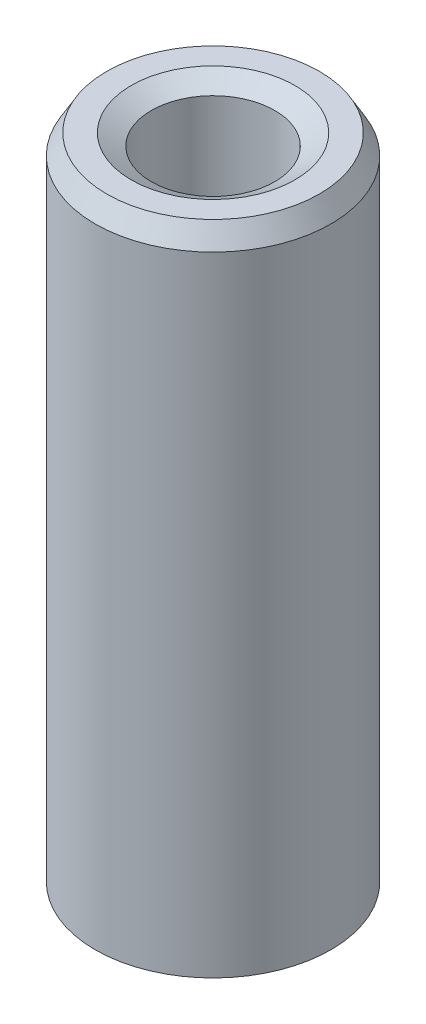
ISO-10303-21;
HEADER;
FILE_DESCRIPTION(('STEP AP214'),'2;1');
FILE_NAME('part.step','',(''),(''),'','','');
FILE_SCHEMA(('AUTOMOTIVE_DESIGN { 1 0 10303 214 1 1 1 1 }'));
ENDSEC;
DATA;
#1=APPLICATION_CONTEXT('core data for automotive mechanical design processes');
#2=APPLICATION_PROTOCOL_DEFINITION('international standard','automotive_design',2000,#1);
#3=PRODUCT_CONTEXT('',#1,'mechanical');
#4=PRODUCT('Part','Part','',(#3));
#5=PRODUCT_RELATED_PRODUCT_CATEGORY('part','',(#4));
#6=PRODUCT_DEFINITION_FORMATION('','',#4);
#7=PRODUCT_DEFINITION_CONTEXT('part definition',#1,'design');
#8=PRODUCT_DEFINITION('design','',#6,#7);
#9=PRODUCT_DEFINITION_SHAPE('','',#8);
#10=(LENGTH_UNIT() NAMED_UNIT(*) SI_UNIT(.MILLI.,.METRE.));
#11=(NAMED_UNIT(*) PLANE_ANGLE_UNIT() SI_UNIT($,.RADIAN.));
#12=(NAMED_UNIT(*) SI_UNIT($,.STERADIAN.) SOLID_ANGLE_UNIT());
#13=UNCERTAINTY_MEASURE_WITH_UNIT(LENGTH_MEASURE(1.E-05),#10,'distance_accuracy_value','');
#14=(GEOMETRIC_REPRESENTATION_CONTEXT(3) GLOBAL_UNCERTAINTY_ASSIGNED_CONTEXT((#13)) GLOBAL_UNIT_ASSIGNED_CONTEXT((#10,
#11,#12)) REPRESENTATION_CONTEXT('',''));
#15=CARTESIAN_POINT('',(0.,0.,0.));
#16=DIRECTION('',(0.,0.,1.));
#17=DIRECTION('',(1.,0.,0.));
#18=AXIS2_PLACEMENT_3D('',#15,#16,#17);
#19=CARTESIAN_POINT('',(0.,84.0063016727272,0.));
#20=DIRECTION('',(0.,-1.,0.));
#21=DIRECTION('',(0.,0.,-1.));
#22=AXIS2_PLACEMENT_3D('',#19,#20,#21);
#23=CYLINDRICAL_SURFACE('',#22,15.);
#24=CARTESIAN_POINT('',(0.,1.4764004565903,0.));
#25=DIRECTION('',(0.,1.,0.));
#26=DIRECTION('',(0.,0.,1.));
#27=AXIS2_PLACEMENT_3D('',#24,#25,#26);
#28=CIRCLE('',#27,15.);
#29=CARTESIAN_POINT('',(0.,1.4764004565903,15.));
#30=VERTEX_POINT('',#29);
#31=EDGE_CURVE('E10',#30,#30,#28,.T.);
#32=ORIENTED_EDGE('',*,*,#31,.T.);
#33=EDGE_LOOP('',(#32));
#34=FACE_BOUND('',#33,.T.);
#35=CARTESIAN_POINT('',(0.,81.4491010695949,0.));
#36=DIRECTION('',(0.,1.,0.));
#37=DIRECTION('',(0.,0.,1.));
#38=AXIS2_PLACEMENT_3D('',#35,#36,#37);
#39=CIRCLE('',#38,15.);
#40=CARTESIAN_POINT('',(0.,81.4491010695949,15.));
#41=VERTEX_POINT('',#40);
#42=EDGE_CURVE('E50',#41,#41,#39,.F.);
#43=ORIENTED_EDGE('',*,*,#42,.T.);
#44=EDGE_LOOP('',(#43));
#45=FACE_BOUND('',#44,.T.);
#46=ADVANCED_FACE('F39',(#34,#45),#23,.T.);
#47=CARTESIAN_POINT('',(0.,84.0063016727272,0.));
#48=DIRECTION('',(0.,1.,0.));
#49=DIRECTION('',(0.,0.,1.));
#50=AXIS2_PLACEMENT_3D('',#47,#48,#49);
#51=PLANE('',#50);
#52=CARTESIAN_POINT('',(0.,84.0063016727272,0.));
#53=DIRECTION('',(0.,1.,0.));
#54=DIRECTION('',(0.,0.,1.));
#55=AXIS2_PLACEMENT_3D('',#52,#53,#54);
#56=CIRCLE('',#55,10.4116400235314);
#57=CARTESIAN_POINT('',(0.,84.0063016727272,10.4116400235314));
#58=VERTEX_POINT('',#57);
#59=EDGE_CURVE('E58',#58,#58,#56,.F.);
#60=ORIENTED_EDGE('',*,*,#59,.T.);
#61=EDGE_LOOP('',(#60));
#62=FACE_BOUND('',#61,.T.);
#63=CARTESIAN_POINT('',(0.,84.0063016727272,0.));
#64=DIRECTION('',(0.,1.,0.));
#65=DIRECTION('',(0.,0.,1.));
#66=AXIS2_PLACEMENT_3D('',#63,#64,#65);
#67=CIRCLE('',#66,13.5235995434097);
#68=CARTESIAN_POINT('',(0.,84.0063016727272,13.5235995434097));
#69=VERTEX_POINT('',#68);
#70=EDGE_CURVE('E61',#69,#69,#67,.T.);
#71=ORIENTED_EDGE('',*,*,#70,.T.);
#72=EDGE_LOOP('',(#71));
#73=FACE_BOUND('',#72,.T.);
#74=ADVANCED_FACE('F88',(#62,#73),#51,.T.);
#75=CARTESIAN_POINT('',(0.,0.,0.));
#76=DIRECTION('',(0.,1.,0.));
#77=DIRECTION('',(0.,0.,1.));
#78=AXIS2_PLACEMENT_3D('',#75,#76,#77);
#79=PLANE('',#78);
#80=CARTESIAN_POINT('',(0.,0.,0.));
#81=DIRECTION('',(0.,1.,0.));
#82=DIRECTION('',(0.,0.,1.));
#83=AXIS2_PLACEMENT_3D('',#80,#81,#82);
#84=CIRCLE('',#83,9.33083987698939);
#85=CARTESIAN_POINT('',(0.,0.,9.33083987698939));
#86=VERTEX_POINT('',#85);
#87=EDGE_CURVE('E51',#86,#86,#84,.T.);
#88=ORIENTED_EDGE('',*,*,#87,.T.);
#89=EDGE_LOOP('',(#88));
#90=FACE_BOUND('',#89,.T.);
#91=CARTESIAN_POINT('',(0.,0.,0.));
#92=DIRECTION('',(0.,1.,0.));
#93=DIRECTION('',(0.,0.,1.));
#94=AXIS2_PLACEMENT_3D('',#91,#92,#93);
#95=CIRCLE('',#94,12.4427993968677);
#96=CARTESIAN_POINT('',(0.,0.,12.4427993968677));
#97=VERTEX_POINT('',#96);
#98=EDGE_CURVE('E54',#97,#97,#95,.F.);
#99=ORIENTED_EDGE('',*,*,#98,.T.);
#100=EDGE_LOOP('',(#99));
#101=FACE_BOUND('',#100,.T.);
#102=ADVANCED_FACE('F83',(#90,#101),#79,.F.);
#103=CARTESIAN_POINT('',(0.,84.0063016727272,0.));
#104=DIRECTION('',(0.,-1.,0.));
#105=DIRECTION('',(0.,0.,-1.));
#106=AXIS2_PLACEMENT_3D('',#103,#104,#105);
#107=CYLINDRICAL_SURFACE('',#106,7.85443942039906);
#108=CARTESIAN_POINT('',(0.,82.5299012161369,0.));
#109=DIRECTION('',(0.,1.,0.));
#110=DIRECTION('',(0.,0.,1.));
#111=AXIS2_PLACEMENT_3D('',#108,#109,#110);
#112=CIRCLE('',#111,7.85443942039906);
#113=CARTESIAN_POINT('',(0.,82.5299012161369,7.85443942039905));
#114=VERTEX_POINT('',#113);
#115=EDGE_CURVE('E67',#114,#114,#112,.T.);
#116=ORIENTED_EDGE('',*,*,#115,.T.);
#117=EDGE_LOOP('',(#116));
#118=FACE_BOUND('',#117,.T.);
#119=CARTESIAN_POINT('',(0.,2.55720060313236,0.));
#120=DIRECTION('',(0.,1.,0.));
#121=DIRECTION('',(0.,0.,1.));
#122=AXIS2_PLACEMENT_3D('',#119,#120,#121);
#123=CIRCLE('',#122,7.85443942039906);
#124=CARTESIAN_POINT('',(0.,2.55720060313236,7.85443942039906));
#125=VERTEX_POINT('',#124);
#126=EDGE_CURVE('E69',#125,#125,#123,.F.);
#127=ORIENTED_EDGE('',*,*,#126,.T.);
#128=EDGE_LOOP('',(#127));
#129=FACE_BOUND('',#128,.T.);
#130=ADVANCED_FACE('F71',(#118,#129),#107,.F.);
#131=CARTESIAN_POINT('',(0.,82.5299012161369,0.));
#132=DIRECTION('',(0.,1.,0.));
#133=DIRECTION('',(0.,0.,1.));
#134=AXIS2_PLACEMENT_3D('',#131,#132,#133);
#135=CONICAL_SURFACE('',#134,7.85443942039906,1.0471975511966);
#136=CARTESIAN_POINT('',(0.,84.0063016727272,10.4116400235314));
#137=CARTESIAN_POINT('',(0.,83.9909225013044,10.3850025172488));
#138=CARTESIAN_POINT('',(0.,83.9755433298816,10.3583650109661));
#139=CARTESIAN_POINT('',(0.,83.944784987036,10.3050899984009));
#140=CARTESIAN_POINT('',(0.,83.9294058156132,10.2784524921183));
#141=CARTESIAN_POINT('',(0.,83.8986474727675,10.225177479553));
#142=CARTESIAN_POINT('',(0.,83.8832683013447,10.1985399732704));
#143=CARTESIAN_POINT('',(0.,83.8525099584991,10.1452649607051));
#144=CARTESIAN_POINT('',(0.,83.8371307870762,10.1186274544225));
#145=CARTESIAN_POINT('',(0.,83.8063724442306,10.0653524418572));
#146=CARTESIAN_POINT('',(0.,83.7909932728078,10.0387149355746));
#147=CARTESIAN_POINT('',(0.,83.7602349299622,9.98543992300934));
#148=CARTESIAN_POINT('',(0.,83.7448557585393,9.95880241672671));
#149=CARTESIAN_POINT('',(0.,83.7140974156937,9.90552740416146));
#150=CARTESIAN_POINT('',(0.,83.6987182442709,9.87888989787883));
#151=CARTESIAN_POINT('',(0.,83.6679599014253,9.82561488531357));
#152=CARTESIAN_POINT('',(0.,83.6525807300025,9.79897737903094));
#153=CARTESIAN_POINT('',(0.,83.6218223871568,9.74570236646569));
#154=CARTESIAN_POINT('',(0.,83.606443215734,9.71906486018306));
#155=CARTESIAN_POINT('',(0.,83.5756848728884,9.6657898476178));
#156=CARTESIAN_POINT('',(0.,83.5603057014656,9.63915234133517));
#157=CARTESIAN_POINT('',(0.,83.5295473586199,9.58587732876991));
#158=CARTESIAN_POINT('',(0.,83.5141681871971,9.55923982248728));
#159=CARTESIAN_POINT('',(0.,83.4834098443515,9.50596480992203));
#160=CARTESIAN_POINT('',(0.,83.4680306729287,9.4793273036394));
#161=CARTESIAN_POINT('',(0.,83.437272330083,9.42605229107414));
#162=CARTESIAN_POINT('',(0.,83.4218931586602,9.39941478479151));
#163=CARTESIAN_POINT('',(0.,83.3911348158146,9.34613977222626));
#164=CARTESIAN_POINT('',(0.,83.3757556443918,9.31950226594362));
#165=CARTESIAN_POINT('',(0.,83.3449973015461,9.26622725337837));
#166=CARTESIAN_POINT('',(0.,83.3296181301233,9.23958974709574));
#167=CARTESIAN_POINT('',(0.,83.2988597872777,9.18631473453048));
#168=CARTESIAN_POINT('',(0.,83.2834806158549,9.15967722824785));
#169=CARTESIAN_POINT('',(0.,83.2527222730092,9.1064022156826));
#170=CARTESIAN_POINT('',(0.,83.2373431015864,9.07976470939997));
#171=CARTESIAN_POINT('',(0.,83.2065847587408,9.02648969683471));
#172=CARTESIAN_POINT('',(0.,83.191205587318,8.99985219055208));
#173=CARTESIAN_POINT('',(0.,83.1604472444723,8.94657717798682));
#174=CARTESIAN_POINT('',(0.,83.1450680730495,8.9199396717042));
#175=CARTESIAN_POINT('',(0.,83.1143097302039,8.86666465913894));
#176=CARTESIAN_POINT('',(0.,83.0989305587811,8.84002715285631));
#177=CARTESIAN_POINT('',(0.,83.0681722159354,8.78675214029105));
#178=CARTESIAN_POINT('',(0.,83.0527930445126,8.76011463400842));
#179=CARTESIAN_POINT('',(0.,83.022034701667,8.70683962144317));
#180=CARTESIAN_POINT('',(0.,83.0066555302442,8.68020211516054));
#181=CARTESIAN_POINT('',(0.,82.9758971873986,8.62692710259528));
#182=CARTESIAN_POINT('',(0.,82.9605180159758,8.60028959631265));
#183=CARTESIAN_POINT('',(0.,82.9297596731301,8.54701458374739));
#184=CARTESIAN_POINT('',(0.,82.9143805017073,8.52037707746477));
#185=CARTESIAN_POINT('',(0.,82.8836221588617,8.46710206489951));
#186=CARTESIAN_POINT('',(0.,82.8682429874388,8.44046455861688));
#187=CARTESIAN_POINT('',(0.,82.8374846445932,8.38718954605162));
#188=CARTESIAN_POINT('',(0.,82.8221054731704,8.36055203976899));
#189=CARTESIAN_POINT('',(0.,82.7913471303248,8.30727702720374));
#190=CARTESIAN_POINT('',(0.,82.7759679589019,8.28063952092111));
#191=CARTESIAN_POINT('',(0.,82.7452096160563,8.22736450835585));
#192=CARTESIAN_POINT('',(0.,82.7298304446335,8.20072700207322));
#193=CARTESIAN_POINT('',(0.,82.6990721017879,8.14745198950797));
#194=CARTESIAN_POINT('',(0.,82.6836929303651,8.12081448322533));
#195=CARTESIAN_POINT('',(0.,82.6529345875194,8.06753947066008));
#196=CARTESIAN_POINT('',(0.,82.6375554160966,8.04090196437745));
#197=CARTESIAN_POINT('',(0.,82.606797073251,7.98762695181219));
#198=CARTESIAN_POINT('',(0.,82.5914179018282,7.96098944552956));
#199=CARTESIAN_POINT('',(0.,82.5606595589825,7.90771443296431));
#200=CARTESIAN_POINT('',(0.,82.5452803875597,7.88107692668168));
#201=CARTESIAN_POINT('',(0.,82.5299012161369,7.85443942039905));
#202=B_SPLINE_CURVE_WITH_KNOTS('',3,(#136,#137,#138,#139,#140,#141,#142,#143,#144,#145,#146,
#147,#148,#149,#150,#151,#152,#153,#154,#155,#156,#157,#158,#159,#160,#161,#162,#163,#164,#165,
#166,#167,#168,#169,#170,#171,#172,#173,#174,#175,#176,#177,#178,#179,#180,#181,#182,#183,#184,
#185,#186,#187,#188,#189,#190,#191,#192,#193,#194,#195,#196,#197,#198,#199,#200,#201),
.UNSPECIFIED.,.F.,.F.,(4,2,2,2,2,2,2,2,2,2,2,2,2,2,2,2,2,2,2,2,2,2,2,2,2,2,2,2,2,2,2,2,4),(0.,
0.0922750285368967,0.184550057073793,0.27682508561069,0.369100114147587,0.461375142684483,
0.55365017122138,0.645925199758277,0.738200228295172,0.830475256832069,0.922750285368965,
1.01502531390585,1.10730034244275,1.19957537097965,1.29185039951655,1.38412542805344,
1.47640045659034,1.56867548512723,1.66095051366413,1.75322554220103,1.84550057073792,
1.93777559927482,2.03005062781171,2.12232565634861,2.2146006848855,2.3068757134224,
2.3991507419593,2.49142577049619,2.58370079903309,2.67597582756999,2.76825085610688,
2.86052588464378,2.95280091318067),.UNSPECIFIED.);
#203=EDGE_CURVE('BSEAM77',#58,#114,#202,.T.);
#204=ORIENTED_EDGE('',*,*,#59,.F.);
#205=ORIENTED_EDGE('',*,*,#115,.F.);
#206=ORIENTED_EDGE('',*,*,#203,.T.);
#207=ORIENTED_EDGE('',*,*,#203,.F.);
#208=EDGE_LOOP('',(#204,#206,#205,#207));
#209=FACE_BOUND('',#208,.T.);
#210=ADVANCED_FACE('F77',(#209),#135,.F.);
#211=CARTESIAN_POINT('',(0.,0.,0.));
#212=DIRECTION('',(0.,-1.,0.));
#213=DIRECTION('',(0.,0.,-1.));
#214=AXIS2_PLACEMENT_3D('',#211,#212,#213);
#215=CONICAL_SURFACE('',#214,9.33083987698939,0.523598775598294);
#216=ORIENTED_EDGE('',*,*,#126,.F.);
#217=EDGE_LOOP('',(#216));
#218=FACE_BOUND('',#217,.T.);
#219=ORIENTED_EDGE('',*,*,#87,.F.);
#220=EDGE_LOOP('',(#219));
#221=FACE_BOUND('',#220,.T.);
#222=ADVANCED_FACE('F73',(#218,#221),#215,.F.);
#223=CARTESIAN_POINT('',(0.,1.4764004565903,0.));
#224=DIRECTION('',(0.,1.,0.));
#225=DIRECTION('',(0.,0.,1.));
#226=AXIS2_PLACEMENT_3D('',#223,#224,#225);
#227=CONICAL_SURFACE('',#226,15.,1.0471975511966);
#228=CARTESIAN_POINT('',(0.,0.,12.4427993968677));
#229=CARTESIAN_POINT('',(0.,0.0153791714228162,12.4694369031503));
#230=CARTESIAN_POINT('',(0.,0.0307583428456315,12.4960744094329));
#231=CARTESIAN_POINT('',(0.,0.0615166856912621,12.5493494219982));
#232=CARTESIAN_POINT('',(0.,0.0768958571140774,12.5759869282808));
#233=CARTESIAN_POINT('',(0.,0.107654199959709,12.6292619408461));
#234=CARTESIAN_POINT('',(0.,0.123033371382525,12.6558994471287));
#235=CARTESIAN_POINT('',(0.,0.153791714228156,12.709174459694));
#236=CARTESIAN_POINT('',(0.,0.169170885650971,12.7358119659766));
#237=CARTESIAN_POINT('',(0.,0.199929228496602,12.7890869785419));
#238=CARTESIAN_POINT('',(0.,0.215308399919418,12.8157244848245));
#239=CARTESIAN_POINT('',(0.,0.246066742765049,12.8689994973897));
#240=CARTESIAN_POINT('',(0.,0.261445914187865,12.8956370036724));
#241=CARTESIAN_POINT('',(0.,0.292204257033496,12.9489120162376));
#242=CARTESIAN_POINT('',(0.,0.307583428456312,12.9755495225203));
#243=CARTESIAN_POINT('',(0.,0.338341771301943,13.0288245350855));
#244=CARTESIAN_POINT('',(0.,0.353720942724758,13.0554620413681));
#245=CARTESIAN_POINT('',(0.,0.384479285570389,13.1087370539334));
#246=CARTESIAN_POINT('',(0.,0.399858456993205,13.135374560216));
#247=CARTESIAN_POINT('',(0.,0.430616799838836,13.1886495727813));
#248=CARTESIAN_POINT('',(0.,0.445995971261652,13.2152870790639));
#249=CARTESIAN_POINT('',(0.,0.476754314107283,13.2685620916292));
#250=CARTESIAN_POINT('',(0.,0.492133485530098,13.2951995979118));
#251=CARTESIAN_POINT('',(0.,0.52289182837573,13.3484746104771));
#252=CARTESIAN_POINT('',(0.,0.538270999798545,13.3751121167597));
#253=CARTESIAN_POINT('',(0.,0.569029342644176,13.4283871293249));
#254=CARTESIAN_POINT('',(0.,0.584408514066992,13.4550246356076));
#255=CARTESIAN_POINT('',(0.,0.615166856912623,13.5082996481728));
#256=CARTESIAN_POINT('',(0.,0.630546028335439,13.5349371544555));
#257=CARTESIAN_POINT('',(0.,0.66130437118107,13.5882121670207));
#258=CARTESIAN_POINT('',(0.,0.676683542603886,13.6148496733033));
#259=CARTESIAN_POINT('',(0.,0.707441885449517,13.6681246858686));
#260=CARTESIAN_POINT('',(0.,0.722821056872332,13.6947621921512));
#261=CARTESIAN_POINT('',(0.,0.753579399717964,13.7480372047165));
#262=CARTESIAN_POINT('',(0.,0.768958571140779,13.7746747109991));
#263=CARTESIAN_POINT('',(0.,0.79971691398641,13.8279497235644));
#264=CARTESIAN_POINT('',(0.,0.815096085409226,13.854587229847));
#265=CARTESIAN_POINT('',(0.,0.845854428254857,13.9078622424122));
#266=CARTESIAN_POINT('',(0.,0.861233599677673,13.9344997486949));
#267=CARTESIAN_POINT('',(0.,0.891991942523304,13.9877747612601));
#268=CARTESIAN_POINT('',(0.,0.907371113946119,14.0144122675428));
#269=CARTESIAN_POINT('',(0.,0.938129456791751,14.067687280108));
#270=CARTESIAN_POINT('',(0.,0.953508628214566,14.0943247863906));
#271=CARTESIAN_POINT('',(0.,0.984266971060197,14.1475997989559));
#272=CARTESIAN_POINT('',(0.,0.999646142483013,14.1742373052385));
#273=CARTESIAN_POINT('',(0.,1.03040448532864,14.2275123178038));
#274=CARTESIAN_POINT('',(0.,1.04578365675146,14.2541498240864));
#275=CARTESIAN_POINT('',(0.,1.07654199959709,14.3074248366517));
#276=CARTESIAN_POINT('',(0.,1.09192117101991,14.3340623429343));
#277=CARTESIAN_POINT('',(0.,1.12267951386554,14.3873373554996));
#278=CARTESIAN_POINT('',(0.,1.13805868528835,14.4139748617822));
#279=CARTESIAN_POINT('',(0.,1.16881702813398,14.4672498743474));
#280=CARTESIAN_POINT('',(0.,1.1841961995568,14.4938873806301));
#281=CARTESIAN_POINT('',(0.,1.21495454240243,14.5471623931953));
#282=CARTESIAN_POINT('',(0.,1.23033371382525,14.5737998994779));
#283=CARTESIAN_POINT('',(0.,1.26109205667088,14.6270749120432));
#284=CARTESIAN_POINT('',(0.,1.27647122809369,14.6537124183258));
#285=CARTESIAN_POINT('',(0.,1.30722957093932,14.7069874308911));
#286=CARTESIAN_POINT('',(0.,1.32260874236214,14.7336249371737));
#287=CARTESIAN_POINT('',(0.,1.35336708520777,14.786899949739));
#288=CARTESIAN_POINT('',(0.,1.36874625663059,14.8135374560216));
#289=CARTESIAN_POINT('',(0.,1.39950459947622,14.8668124685869));
#290=CARTESIAN_POINT('',(0.,1.41488377089903,14.8934499748695));
#291=CARTESIAN_POINT('',(0.,1.44564211374466,14.9467249874347));
#292=CARTESIAN_POINT('',(0.,1.46102128516748,14.9733624937174));
#293=CARTESIAN_POINT('',(0.,1.4764004565903,15.));
#294=B_SPLINE_CURVE_WITH_KNOTS('',3,(#228,#229,#230,#231,#232,#233,#234,#235,#236,#237,#238,
#239,#240,#241,#242,#243,#244,#245,#246,#247,#248,#249,#250,#251,#252,#253,#254,#255,#256,#257,
#258,#259,#260,#261,#262,#263,#264,#265,#266,#267,#268,#269,#270,#271,#272,#273,#274,#275,#276,
#277,#278,#279,#280,#281,#282,#283,#284,#285,#286,#287,#288,#289,#290,#291,#292,#293),
.UNSPECIFIED.,.F.,.F.,(4,2,2,2,2,2,2,2,2,2,2,2,2,2,2,2,2,2,2,2,2,2,2,2,2,2,2,2,2,2,2,2,4),(0.,
0.0922750285368926,0.184550057073788,0.276825085610681,0.369100114147576,0.461375142684469,
0.553650171221365,0.645925199758257,0.738200228295153,0.830475256832045,0.922750285368941,
1.01502531390583,1.10730034244273,1.19957537097962,1.29185039951652,1.38412542805341,
1.47640045659031,1.5686754851272,1.66095051366409,1.75322554220099,1.84550057073788,
1.93777559927478,2.03005062781167,2.12232565634856,2.21460068488546,2.30687571342235,
2.39915074195925,2.49142577049614,2.58370079903303,2.67597582756993,2.76825085610682,
2.86052588464372,2.95280091318061),.UNSPECIFIED.);
#295=EDGE_CURVE('BSEAM76',#97,#30,#294,.T.);
#296=ORIENTED_EDGE('',*,*,#98,.F.);
#297=ORIENTED_EDGE('',*,*,#31,.F.);
#298=ORIENTED_EDGE('',*,*,#295,.T.);
#299=ORIENTED_EDGE('',*,*,#295,.F.);
#300=EDGE_LOOP('',(#296,#298,#297,#299));
#301=FACE_BOUND('',#300,.T.);
#302=ADVANCED_FACE('F76',(#301),#227,.T.);
#303=CARTESIAN_POINT('',(0.,84.0063016727272,0.));
#304=DIRECTION('',(0.,-1.,0.));
#305=DIRECTION('',(0.,0.,-1.));
#306=AXIS2_PLACEMENT_3D('',#303,#304,#305);
#307=CONICAL_SURFACE('',#306,13.5235995434097,0.523598775598296);
#308=ORIENTED_EDGE('',*,*,#42,.F.);
#309=EDGE_LOOP('',(#308));
#310=FACE_BOUND('',#309,.T.);
#311=ORIENTED_EDGE('',*,*,#70,.F.);
#312=EDGE_LOOP('',(#311));
#313=FACE_BOUND('',#312,.T.);
#314=ADVANCED_FACE('F45',(#310,#313),#307,.T.);
#315=CLOSED_SHELL('',(#46,#74,#102,#130,#210,#222,#302,#314));
#316=MANIFOLD_SOLID_BREP('B2',#315);
#317=ADVANCED_BREP_SHAPE_REPRESENTATION('',(#18,#316),#14);
#318=SHAPE_DEFINITION_REPRESENTATION(#9,#317);
ENDSEC;
END-ISO-10303-21;
